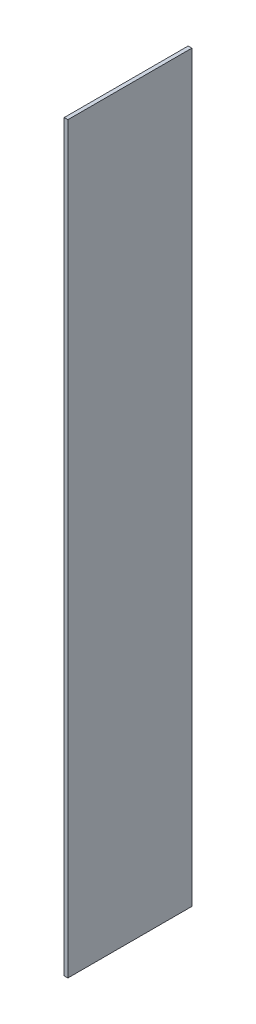
ISO-10303-21;
HEADER;
FILE_DESCRIPTION(('STEP AP214'),'2;1');
FILE_NAME('part.step','',(''),(''),'','','');
FILE_SCHEMA(('AUTOMOTIVE_DESIGN { 1 0 10303 214 1 1 1 1 }'));
ENDSEC;
DATA;
#1=APPLICATION_CONTEXT('core data for automotive mechanical design processes');
#2=APPLICATION_PROTOCOL_DEFINITION('international standard','automotive_design',2000,#1);
#3=PRODUCT_CONTEXT('',#1,'mechanical');
#4=PRODUCT('Part','Part','',(#3));
#5=PRODUCT_RELATED_PRODUCT_CATEGORY('part','',(#4));
#6=PRODUCT_DEFINITION_FORMATION('','',#4);
#7=PRODUCT_DEFINITION_CONTEXT('part definition',#1,'design');
#8=PRODUCT_DEFINITION('design','',#6,#7);
#9=PRODUCT_DEFINITION_SHAPE('','',#8);
#10=(LENGTH_UNIT() NAMED_UNIT(*) SI_UNIT(.MILLI.,.METRE.));
#11=(NAMED_UNIT(*) PLANE_ANGLE_UNIT() SI_UNIT($,.RADIAN.));
#12=(NAMED_UNIT(*) SI_UNIT($,.STERADIAN.) SOLID_ANGLE_UNIT());
#13=UNCERTAINTY_MEASURE_WITH_UNIT(LENGTH_MEASURE(1.E-05),#10,'distance_accuracy_value','');
#14=(GEOMETRIC_REPRESENTATION_CONTEXT(3) GLOBAL_UNCERTAINTY_ASSIGNED_CONTEXT((#13)) GLOBAL_UNIT_ASSIGNED_CONTEXT((#10,
#11,#12)) REPRESENTATION_CONTEXT('',''));
#15=CARTESIAN_POINT('',(0.,0.,0.));
#16=DIRECTION('',(0.,0.,1.));
#17=DIRECTION('',(1.,0.,0.));
#18=AXIS2_PLACEMENT_3D('',#15,#16,#17);
#19=CARTESIAN_POINT('',(0.749999999999997,150.,-25.));
#20=DIRECTION('',(-1.,0.,0.));
#21=DIRECTION('',(0.,0.,1.));
#22=AXIS2_PLACEMENT_3D('',#19,#20,#21);
#23=PLANE('',#22);
#24=DIRECTION('',(0.,0.,-1.));
#25=VECTOR('',#24,1.);
#26=CARTESIAN_POINT('',(0.749999999999997,-150.,-25.));
#27=LINE('',#26,#25);
#28=CARTESIAN_POINT('',(0.750000000000002,-150.,25.));
#29=VERTEX_POINT('',#28);
#30=CARTESIAN_POINT('',(0.749999999999997,-150.,-25.));
#31=VERTEX_POINT('',#30);
#32=EDGE_CURVE('E96',#29,#31,#27,.T.);
#33=ORIENTED_EDGE('',*,*,#32,.T.);
#34=DIRECTION('',(0.,-1.,0.));
#35=VECTOR('',#34,1.);
#36=CARTESIAN_POINT('',(0.749999999999997,150.,-25.));
#37=LINE('',#36,#35);
#38=CARTESIAN_POINT('',(0.749999999999997,150.,-25.));
#39=VERTEX_POINT('',#38);
#40=EDGE_CURVE('E11',#39,#31,#37,.T.);
#41=ORIENTED_EDGE('',*,*,#40,.F.);
#42=DIRECTION('',(0.,0.,-1.));
#43=VECTOR('',#42,1.);
#44=CARTESIAN_POINT('',(0.749999999999997,150.,-25.));
#45=LINE('',#44,#43);
#46=CARTESIAN_POINT('',(0.750000000000002,150.,25.));
#47=VERTEX_POINT('',#46);
#48=EDGE_CURVE('E84',#47,#39,#45,.T.);
#49=ORIENTED_EDGE('',*,*,#48,.F.);
#50=DIRECTION('',(0.,-1.,0.));
#51=VECTOR('',#50,1.);
#52=CARTESIAN_POINT('',(0.750000000000002,150.,25.));
#53=LINE('',#52,#51);
#54=EDGE_CURVE('E92',#47,#29,#53,.T.);
#55=ORIENTED_EDGE('',*,*,#54,.T.);
#56=EDGE_LOOP('',(#33,#41,#49,#55));
#57=FACE_BOUND('',#56,.T.);
#58=ADVANCED_FACE('F33',(#57),#23,.F.);
#59=CARTESIAN_POINT('',(-0.750000000000002,150.,-25.));
#60=DIRECTION('',(0.,0.,1.));
#61=DIRECTION('',(1.,0.,0.));
#62=AXIS2_PLACEMENT_3D('',#59,#60,#61);
#63=PLANE('',#62);
#64=DIRECTION('',(-1.,0.,0.));
#65=VECTOR('',#64,1.);
#66=CARTESIAN_POINT('',(-0.750000000000002,-150.,-25.));
#67=LINE('',#66,#65);
#68=CARTESIAN_POINT('',(-0.750000000000002,-150.,-25.));
#69=VERTEX_POINT('',#68);
#70=EDGE_CURVE('E88',#31,#69,#67,.T.);
#71=ORIENTED_EDGE('',*,*,#70,.T.);
#72=DIRECTION('',(0.,-1.,0.));
#73=VECTOR('',#72,1.);
#74=CARTESIAN_POINT('',(-0.750000000000002,150.,-25.));
#75=LINE('',#74,#73);
#76=CARTESIAN_POINT('',(-0.750000000000002,150.,-25.));
#77=VERTEX_POINT('',#76);
#78=EDGE_CURVE('E41',#77,#69,#75,.T.);
#79=ORIENTED_EDGE('',*,*,#78,.F.);
#80=DIRECTION('',(-1.,0.,0.));
#81=VECTOR('',#80,1.);
#82=CARTESIAN_POINT('',(-0.750000000000002,150.,-25.));
#83=LINE('',#82,#81);
#84=EDGE_CURVE('E79',#39,#77,#83,.T.);
#85=ORIENTED_EDGE('',*,*,#84,.F.);
#86=ORIENTED_EDGE('',*,*,#40,.T.);
#87=EDGE_LOOP('',(#71,#79,#85,#86));
#88=FACE_BOUND('',#87,.T.);
#89=ADVANCED_FACE('F87',(#88),#63,.F.);
#90=CARTESIAN_POINT('',(-0.750000000000002,150.,-25.));
#91=DIRECTION('',(1.,0.,0.));
#92=DIRECTION('',(0.,0.,-1.));
#93=AXIS2_PLACEMENT_3D('',#90,#91,#92);
#94=PLANE('',#93);
#95=DIRECTION('',(0.,0.,1.));
#96=VECTOR('',#95,1.);
#97=CARTESIAN_POINT('',(-0.750000000000002,-150.,-25.));
#98=LINE('',#97,#96);
#99=CARTESIAN_POINT('',(-0.749999999999997,-150.,25.));
#100=VERTEX_POINT('',#99);
#101=EDGE_CURVE('E66',#69,#100,#98,.T.);
#102=ORIENTED_EDGE('',*,*,#101,.T.);
#103=DIRECTION('',(0.,-1.,0.));
#104=VECTOR('',#103,1.);
#105=CARTESIAN_POINT('',(-0.749999999999997,150.,25.));
#106=LINE('',#105,#104);
#107=CARTESIAN_POINT('',(-0.749999999999997,150.,25.));
#108=VERTEX_POINT('',#107);
#109=EDGE_CURVE('E89',#108,#100,#106,.T.);
#110=ORIENTED_EDGE('',*,*,#109,.F.);
#111=DIRECTION('',(0.,0.,1.));
#112=VECTOR('',#111,1.);
#113=CARTESIAN_POINT('',(-0.750000000000002,150.,-25.));
#114=LINE('',#113,#112);
#115=EDGE_CURVE('E82',#77,#108,#114,.T.);
#116=ORIENTED_EDGE('',*,*,#115,.F.);
#117=ORIENTED_EDGE('',*,*,#78,.T.);
#118=EDGE_LOOP('',(#102,#110,#116,#117));
#119=FACE_BOUND('',#118,.T.);
#120=ADVANCED_FACE('F90',(#119),#94,.F.);
#121=CARTESIAN_POINT('',(-0.749999999999997,150.,25.));
#122=DIRECTION('',(0.,0.,-1.));
#123=DIRECTION('',(-1.,0.,0.));
#124=AXIS2_PLACEMENT_3D('',#121,#122,#123);
#125=PLANE('',#124);
#126=DIRECTION('',(1.,0.,0.));
#127=VECTOR('',#126,1.);
#128=CARTESIAN_POINT('',(-0.749999999999997,-150.,25.));
#129=LINE('',#128,#127);
#130=EDGE_CURVE('E72',#100,#29,#129,.T.);
#131=ORIENTED_EDGE('',*,*,#130,.T.);
#132=ORIENTED_EDGE('',*,*,#54,.F.);
#133=DIRECTION('',(1.,0.,0.));
#134=VECTOR('',#133,1.);
#135=CARTESIAN_POINT('',(-0.749999999999997,150.,25.));
#136=LINE('',#135,#134);
#137=EDGE_CURVE('E49',#108,#47,#136,.T.);
#138=ORIENTED_EDGE('',*,*,#137,.F.);
#139=ORIENTED_EDGE('',*,*,#109,.T.);
#140=EDGE_LOOP('',(#131,#132,#138,#139));
#141=FACE_BOUND('',#140,.T.);
#142=ADVANCED_FACE('F103',(#141),#125,.F.);
#143=CARTESIAN_POINT('',(0.,150.,0.));
#144=DIRECTION('',(0.,1.,0.));
#145=DIRECTION('',(0.,0.,1.));
#146=AXIS2_PLACEMENT_3D('',#143,#144,#145);
#147=PLANE('',#146);
#148=ORIENTED_EDGE('',*,*,#48,.T.);
#149=ORIENTED_EDGE('',*,*,#84,.T.);
#150=ORIENTED_EDGE('',*,*,#115,.T.);
#151=ORIENTED_EDGE('',*,*,#137,.T.);
#152=EDGE_LOOP('',(#148,#149,#150,#151));
#153=FACE_BOUND('',#152,.T.);
#154=ADVANCED_FACE('F80',(#153),#147,.T.);
#155=CARTESIAN_POINT('',(0.,-150.,0.));
#156=DIRECTION('',(0.,1.,0.));
#157=DIRECTION('',(0.,0.,1.));
#158=AXIS2_PLACEMENT_3D('',#155,#156,#157);
#159=PLANE('',#158);
#160=ORIENTED_EDGE('',*,*,#32,.F.);
#161=ORIENTED_EDGE('',*,*,#130,.F.);
#162=ORIENTED_EDGE('',*,*,#101,.F.);
#163=ORIENTED_EDGE('',*,*,#70,.F.);
#164=EDGE_LOOP('',(#160,#161,#162,#163));
#165=FACE_BOUND('',#164,.T.);
#166=ADVANCED_FACE('F106',(#165),#159,.F.);
#167=CLOSED_SHELL('',(#58,#89,#120,#142,#154,#166));
#168=MANIFOLD_SOLID_BREP('B2',#167);
#169=ADVANCED_BREP_SHAPE_REPRESENTATION('',(#18,#168),#14);
#170=SHAPE_DEFINITION_REPRESENTATION(#9,#169);
ENDSEC;
END-ISO-10303-21;
